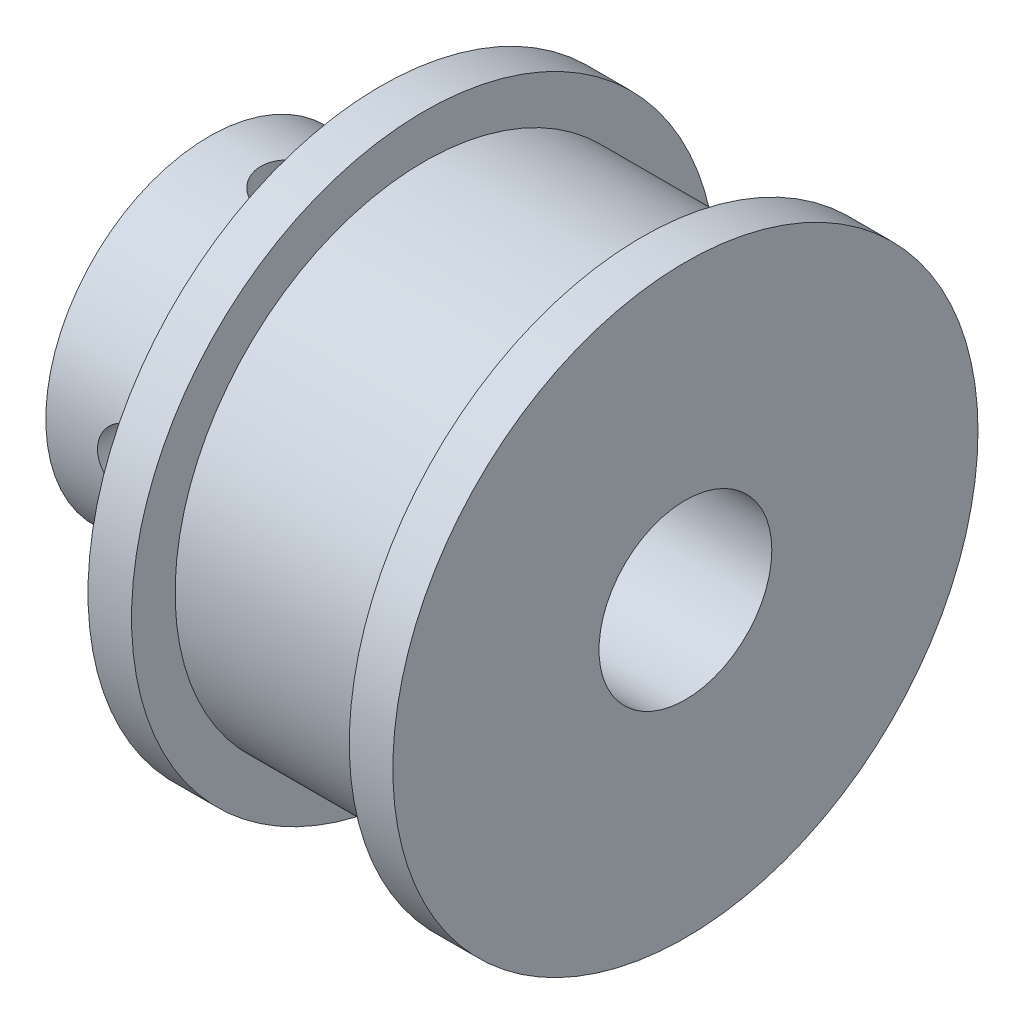
ISO-10303-21;
HEADER;
FILE_DESCRIPTION(('STEP AP214'),'2;1');
FILE_NAME('part.step','',(''),(''),'','','');
FILE_SCHEMA(('AUTOMOTIVE_DESIGN { 1 0 10303 214 1 1 1 1 }'));
ENDSEC;
DATA;
#1=APPLICATION_CONTEXT('core data for automotive mechanical design processes');
#2=APPLICATION_PROTOCOL_DEFINITION('international standard','automotive_design',2000,#1);
#3=PRODUCT_CONTEXT('',#1,'mechanical');
#4=PRODUCT('Part','Part','',(#3));
#5=PRODUCT_RELATED_PRODUCT_CATEGORY('part','',(#4));
#6=PRODUCT_DEFINITION_FORMATION('','',#4);
#7=PRODUCT_DEFINITION_CONTEXT('part definition',#1,'design');
#8=PRODUCT_DEFINITION('design','',#6,#7);
#9=PRODUCT_DEFINITION_SHAPE('','',#8);
#10=(LENGTH_UNIT() NAMED_UNIT(*) SI_UNIT(.MILLI.,.METRE.));
#11=(NAMED_UNIT(*) PLANE_ANGLE_UNIT() SI_UNIT($,.RADIAN.));
#12=(NAMED_UNIT(*) SI_UNIT($,.STERADIAN.) SOLID_ANGLE_UNIT());
#13=UNCERTAINTY_MEASURE_WITH_UNIT(LENGTH_MEASURE(1.E-05),#10,'distance_accuracy_value','');
#14=(GEOMETRIC_REPRESENTATION_CONTEXT(3) GLOBAL_UNCERTAINTY_ASSIGNED_CONTEXT((#13)) GLOBAL_UNIT_ASSIGNED_CONTEXT((#10,
#11,#12)) REPRESENTATION_CONTEXT('',''));
#15=CARTESIAN_POINT('',(0.,0.,0.));
#16=DIRECTION('',(0.,0.,1.));
#17=DIRECTION('',(1.,0.,0.));
#18=AXIS2_PLACEMENT_3D('',#15,#16,#17);
#19=CARTESIAN_POINT('',(0.,0.,0.));
#20=DIRECTION('',(1.,0.,0.));
#21=DIRECTION('',(0.,0.,-1.));
#22=AXIS2_PLACEMENT_3D('',#19,#20,#21);
#23=CYLINDRICAL_SURFACE('',#22,3.175);
#24=CARTESIAN_POINT('',(1.90000000000001,0.,3.175));
#25=CARTESIAN_POINT('',(1.9000068627745,0.0672847316330924,3.17499501338285));
#26=CARTESIAN_POINT('',(1.90546359305505,0.1346703640608,3.17283650663751));
#27=CARTESIAN_POINT('',(1.92710352845715,0.267542369031608,3.16441250521978));
#28=CARTESIAN_POINT('',(1.94331412522152,0.333023444641002,3.15813652319774));
#29=CARTESIAN_POINT('',(1.9857829777871,0.459957962416117,3.14215557601542));
#30=CARTESIAN_POINT('',(2.01200951215206,0.521423409993961,3.1324614438269));
#31=CARTESIAN_POINT('',(2.07364090841074,0.63903164640658,3.11060223187218));
#32=CARTESIAN_POINT('',(2.1090429677438,0.695176053354679,3.09843790684371));
#33=CARTESIAN_POINT('',(2.1897376821198,0.803199302091193,3.07224897424454));
#34=CARTESIAN_POINT('',(2.23538195508738,0.854801684849634,3.05816785515032));
#35=CARTESIAN_POINT('',(2.33452307874792,0.949851027050096,3.029995134943));
#36=CARTESIAN_POINT('',(2.38802352829044,0.993294227940917,3.01590353198658));
#37=CARTESIAN_POINT('',(2.5041424024409,1.07262244667806,2.98863572549245));
#38=CARTESIAN_POINT('',(2.56705314443539,1.10810421355732,2.97552454842956));
#39=CARTESIAN_POINT('',(2.698544027874,1.16785949338492,2.95258553832485));
#40=CARTESIAN_POINT('',(2.7671215628923,1.19213812572271,2.94275620617845));
#41=CARTESIAN_POINT('',(2.90482457540723,1.22768807019404,2.92809906106053));
#42=CARTESIAN_POINT('',(2.97379138336201,1.2394876533875,2.92306908743274));
#43=CARTESIAN_POINT('',(3.11289538673181,1.25139521634013,2.91799267608066));
#44=CARTESIAN_POINT('',(3.18303201481214,1.2515087076257,2.91794388907308));
#45=CARTESIAN_POINT('',(3.31747264612622,1.24044215294952,2.92266241514435));
#46=CARTESIAN_POINT('',(3.38185243388379,1.2300187638983,2.9271070555664));
#47=CARTESIAN_POINT('',(3.50786207063953,1.19943319152663,2.93977143360488));
#48=CARTESIAN_POINT('',(3.56949145415953,1.17926936651212,2.94799180758784));
#49=CARTESIAN_POINT('',(3.68970949878321,1.12939589279822,2.9674595549287));
#50=CARTESIAN_POINT('',(3.74821240698525,1.09950293840843,2.97876432051874));
#51=CARTESIAN_POINT('',(3.85958183190654,1.03114819003906,3.00311044973729));
#52=CARTESIAN_POINT('',(3.91244626347388,0.992683242204219,3.01615245182717));
#53=CARTESIAN_POINT('',(4.01519223792226,0.90489847311778,3.04369028436772));
#54=CARTESIAN_POINT('',(4.06455620057866,0.854982538626526,3.05822195069566));
#55=CARTESIAN_POINT('',(4.15437521291328,0.747422600693478,3.08627133748347));
#56=CARTESIAN_POINT('',(4.19482859712145,0.68977715576794,3.09978886808114));
#57=CARTESIAN_POINT('',(4.26632885010501,0.566964697663757,3.12460676760529));
#58=CARTESIAN_POINT('',(4.29718676961865,0.501677729871156,3.13586122258918));
#59=CARTESIAN_POINT('',(4.34730502697112,0.366284378650628,3.15453954285868));
#60=CARTESIAN_POINT('',(4.36657106552982,0.296180383098904,3.16196529078971));
#61=CARTESIAN_POINT('',(4.39192526522841,0.15748598181363,3.17180954080983));
#62=CARTESIAN_POINT('',(4.398709348115,0.08904145870925,3.174492125026));
#63=CARTESIAN_POINT('',(4.4009546291958,-0.0480536320474739,3.17537559014029));
#64=CARTESIAN_POINT('',(4.39641864995898,-0.116704144074904,3.17357758823769));
#65=CARTESIAN_POINT('',(4.3766688987383,-0.249146112043378,3.1658751934269));
#66=CARTESIAN_POINT('',(4.36192521803439,-0.313019327348947,3.16015168509209));
#67=CARTESIAN_POINT('',(4.32281288402532,-0.437330047990826,3.14535985768854));
#68=CARTESIAN_POINT('',(4.29844298886303,-0.497767108885045,3.1362911070673));
#69=CARTESIAN_POINT('',(4.23997777394203,-0.615550644692232,3.11535083253378));
#70=CARTESIAN_POINT('',(4.20560984846939,-0.672747743207499,3.10340262881889));
#71=CARTESIAN_POINT('',(4.12842792642724,-0.780761917259374,3.07800576012949));
#72=CARTESIAN_POINT('',(4.08561060602606,-0.831576469108153,3.06455650557748));
#73=CARTESIAN_POINT('',(3.98952965745297,-0.928791348114859,3.0365593899859));
#74=CARTESIAN_POINT('',(3.93577293586608,-0.974701227513619,3.02199629492691));
#75=CARTESIAN_POINT('',(3.82105274982168,-1.05696284943212,2.99421855171024));
#76=CARTESIAN_POINT('',(3.76008825217309,-1.09331321924023,2.98100409737911));
#77=CARTESIAN_POINT('',(3.63187774635261,-1.15559997165607,2.95742074651155));
#78=CARTESIAN_POINT('',(3.56458459593159,-1.18144907129597,2.9470759174758));
#79=CARTESIAN_POINT('',(3.4260725952737,-1.2212562072246,2.93080697789355));
#80=CARTESIAN_POINT('',(3.35485655568267,-1.23522264211379,2.92487974538276));
#81=CARTESIAN_POINT('',(3.21589405502895,-1.25007804085777,2.91855940228496));
#82=CARTESIAN_POINT('',(3.1482538653394,-1.25181430561831,2.91780781401761));
#83=CARTESIAN_POINT('',(3.01369577979596,-1.24437120429059,2.92098982763324));
#84=CARTESIAN_POINT('',(2.94677779981834,-1.23519312367105,2.92492287776943));
#85=CARTESIAN_POINT('',(2.81810207173594,-1.20686591196944,2.93671925445626));
#86=CARTESIAN_POINT('',(2.75624498467543,-1.18809939057282,2.9444313340829));
#87=CARTESIAN_POINT('',(2.63652982106708,-1.14148049607648,2.96281485611587));
#88=CARTESIAN_POINT('',(2.57867280512971,-1.1136257243581,2.97348707966731));
#89=CARTESIAN_POINT('',(2.4650674647447,-1.04781462002773,2.99733186522452));
#90=CARTESIAN_POINT('',(2.40961923756217,-1.00937948877753,3.01061106475901));
#91=CARTESIAN_POINT('',(2.30568987821778,-0.924206507043676,3.0378387527675));
#92=CARTESIAN_POINT('',(2.25721118976831,-0.877465757163235,3.05178747371865));
#93=CARTESIAN_POINT('',(2.16551587816836,-0.773553196077986,3.07982295515274));
#94=CARTESIAN_POINT('',(2.12281309958007,-0.715913819660185,3.09386447942524));
#95=CARTESIAN_POINT('',(2.04769454049986,-0.5937664037964,3.11960779538581));
#96=CARTESIAN_POINT('',(2.01528012935281,-0.529257451559142,3.13130927554577));
#97=CARTESIAN_POINT('',(1.96417540099936,-0.400855491445671,3.15020502613284));
#98=CARTESIAN_POINT('',(1.94455266817755,-0.337376283301317,3.15769788512325));
#99=CARTESIAN_POINT('',(1.91563614784328,-0.207895662632507,3.16884766902594));
#100=CARTESIAN_POINT('',(1.90631397142025,-0.141901703524203,3.17251513536217));
#101=CARTESIAN_POINT('',(1.90076135384054,-0.0504531001608372,3.17470085654944));
#102=CARTESIAN_POINT('',(1.8999974262687,-0.0252336457199433,3.17500187012012));
#103=CARTESIAN_POINT('',(1.90000000000001,0.,3.175));
#104=B_SPLINE_CURVE_WITH_KNOTS('',3,(#24,#25,#26,#27,#28,#29,#30,#31,#32,#33,#34,#35,#36,#37,
#38,#39,#40,#41,#42,#43,#44,#45,#46,#47,#48,#49,#50,#51,#52,#53,#54,#55,#56,#57,#58,#59,#60,#61,
#62,#63,#64,#65,#66,#67,#68,#69,#70,#71,#72,#73,#74,#75,#76,#77,#78,#79,#80,#81,#82,#83,#84,#85,
#86,#87,#88,#89,#90,#91,#92,#93,#94,#95,#96,#97,#98,#99,#100,#101,#102,#103),.UNSPECIFIED.,.T.,
.F.,(4,2,2,2,2,2,2,2,2,2,2,2,2,2,2,2,2,2,2,2,2,2,2,2,2,2,2,2,2,2,2,2,2,2,2,2,2,2,2,4),(0.,
0.201779437744548,0.404074820308127,0.605734757050763,0.807333171478417,1.01735976436243,
1.2274828705813,1.44660259463333,1.66562209023744,1.87494520835713,2.08416960269575,
2.27936669865592,2.47459670544107,2.67374147234743,2.87295963102294,3.08705517744558,
3.30119070642572,3.51930901537433,3.73731996902137,3.94275765182502,4.14814411546712,
4.34465147529728,4.54118419440118,4.7436789821994,4.94625358697288,5.1617892735487,
5.37735589340512,5.59467927329235,5.81184892233299,6.01381057507249,6.21574844354767,
6.41019345194811,6.60468982086286,6.81009090996547,7.01556384361703,7.2337987698656,
7.45206273023339,7.65177261299093,7.85093070050895,7.92660360165657),.UNSPECIFIED.);
#105=CARTESIAN_POINT('',(1.90000000000001,0.,3.175));
#106=VERTEX_POINT('',#105);
#107=EDGE_CURVE('E636',#106,#106,#104,.T.);
#108=ORIENTED_EDGE('',*,*,#107,.F.);
#109=EDGE_LOOP('',(#108));
#110=FACE_BOUND('',#109,.T.);
#111=CARTESIAN_POINT('',(3.15,2.91858270398493,-1.25));
#112=CARTESIAN_POINT('',(3.21705876770274,2.91858919552523,-1.24999286391997));
#113=CARTESIAN_POINT('',(3.28421776991305,2.92092645038722,-1.24457161253238));
#114=CARTESIAN_POINT('',(3.41661509708975,2.92998517442319,-1.2230858011541));
#115=CARTESIAN_POINT('',(3.48184795863823,2.93671805691524,-1.20699353198018));
#116=CARTESIAN_POINT('',(3.60825570633315,2.95367783504784,-1.16486992778129));
#117=CARTESIAN_POINT('',(3.66944461339327,2.96389181028401,-1.13887530486567));
#118=CARTESIAN_POINT('',(3.78657755098346,2.98664490940932,-1.07779173231123));
#119=CARTESIAN_POINT('',(3.84252284402701,2.99918347142755,-1.04270497949831));
#120=CARTESIAN_POINT('',(3.95071189018399,3.02595080926506,-0.962353829492942));
#121=CARTESIAN_POINT('',(4.00262881457917,3.04023283739072,-0.916666915264533));
#122=CARTESIAN_POINT('',(4.09830169841413,3.06843728874988,-0.817302314146456));
#123=CARTESIAN_POINT('',(4.1420548518516,3.08235958692784,-0.763621891133198));
#124=CARTESIAN_POINT('',(4.22176349783716,3.10891201177461,-0.64728579706301));
#125=CARTESIAN_POINT('',(4.25735944266869,3.12147292007291,-0.584366556004033));
#126=CARTESIAN_POINT('',(4.31732314068053,3.14324422109986,-0.452850465301555));
#127=CARTESIAN_POINT('',(4.34169532800117,3.15245593668199,-0.384255870461471));
#128=CARTESIAN_POINT('',(4.37736018254707,3.16611423056324,-0.2467608971739));
#129=CARTESIAN_POINT('',(4.38921442617454,3.17076466636064,-0.178026840226493));
#130=CARTESIAN_POINT('',(4.40131288966092,3.17551190440968,-0.0393983009347702));
#131=CARTESIAN_POINT('',(4.40156129942229,3.17561035000669,0.0304957535146294));
#132=CARTESIAN_POINT('',(4.39075388885007,3.17136802875332,0.165409649899385));
#133=CARTESIAN_POINT('',(4.380312782763,3.16726865978232,0.230487686315578));
#134=CARTESIAN_POINT('',(4.34946532592636,3.15541444614498,0.357881536818985));
#135=CARTESIAN_POINT('',(4.32905824593686,3.14765933397851,0.420197148407344));
#136=CARTESIAN_POINT('',(4.27860558354179,3.12910832817148,0.541410179653869));
#137=CARTESIAN_POINT('',(4.24842031728481,3.11826866169305,0.600242482304685));
#138=CARTESIAN_POINT('',(4.17939703639771,3.09462975143761,0.712157346885298));
#139=CARTESIAN_POINT('',(4.1405560971742,3.08182984578998,0.765237956392509));
#140=CARTESIAN_POINT('',(4.05243182003348,3.05461022779038,0.867739124124568));
#141=CARTESIAN_POINT('',(4.00264013608172,3.04013927358102,0.916709689716655));
#142=CARTESIAN_POINT('',(3.89548656480707,3.01184461230875,1.00578635680649));
#143=CARTESIAN_POINT('',(3.83812236311636,2.99802110488019,1.04588973818711));
#144=CARTESIAN_POINT('',(3.71550154425415,2.9722444532213,1.11707822475766));
#145=CARTESIAN_POINT('',(3.6500754582507,2.96035090580402,1.14789479354929));
#146=CARTESIAN_POINT('',(3.5143696785953,2.94047661183176,1.19789603572418));
#147=CARTESIAN_POINT('',(3.44409305117512,2.93249341875955,1.21708798384633));
#148=CARTESIAN_POINT('',(3.30516034266536,2.92193314346724,1.24221885837745));
#149=CARTESIAN_POINT('',(3.2366574611002,2.9190621155793,1.24887973581001));
#150=CARTESIAN_POINT('',(3.09946758767574,2.91821507641654,1.25085924710212));
#151=CARTESIAN_POINT('',(3.03078065469026,2.92023765193577,1.24618115550066));
#152=CARTESIAN_POINT('',(2.89910081239854,2.92864903711891,1.22627220656949));
#153=CARTESIAN_POINT('',(2.83600149325999,2.93479414330475,1.21162973372095));
#154=CARTESIAN_POINT('',(2.71319369775327,2.95045928061593,1.17296502005911));
#155=CARTESIAN_POINT('',(2.65348596177989,2.95998004539956,1.14894074010909));
#156=CARTESIAN_POINT('',(2.53650689226705,2.98178824537218,1.09112415058302));
#157=CARTESIAN_POINT('',(2.47942723563771,2.99417074871089,1.05698098829747));
#158=CARTESIAN_POINT('',(2.37155358654007,3.02015852173764,0.980258179031947));
#159=CARTESIAN_POINT('',(2.32076210314278,3.03376427580628,0.937675181950988));
#160=CARTESIAN_POINT('',(2.22315311375844,3.06183438952279,0.841703377564378));
#161=CARTESIAN_POINT('',(2.17687527629868,3.07629098175068,0.787761391689884));
#162=CARTESIAN_POINT('',(2.09394958907587,3.1035190255834,0.672529083864432));
#163=CARTESIAN_POINT('',(2.05730202921282,3.1162904264532,0.611238540780897));
#164=CARTESIAN_POINT('',(1.99484313276734,3.13873566281396,0.482904338615098));
#165=CARTESIAN_POINT('',(1.96901930828488,3.14841306493411,0.415867417631866));
#166=CARTESIAN_POINT('',(1.92917965457089,3.16357142711523,0.277927786036162));
#167=CARTESIAN_POINT('',(1.91515764017672,3.16905458518296,0.207027121129187));
#168=CARTESIAN_POINT('',(1.90003726977397,3.17497850608976,0.0682260342168539));
#169=CARTESIAN_POINT('',(1.89817498964644,3.17571727826717,0.000420884757595325));
#170=CARTESIAN_POINT('',(1.90542306137319,3.1728670277863,-0.134500374630681));
#171=CARTESIAN_POINT('',(1.9145318409792,3.16927862524971,-0.201616581901098));
#172=CARTESIAN_POINT('',(1.94291936225415,3.15832315585951,-0.331261459507754));
#173=CARTESIAN_POINT('',(1.96189513645233,3.15106882901496,-0.393866748155006));
#174=CARTESIAN_POINT('',(2.00916415022582,3.13355246801338,-0.514998013360591));
#175=CARTESIAN_POINT('',(2.03745913359075,3.12328987099511,-0.573523223978585));
#176=CARTESIAN_POINT('',(2.10396081746341,3.10021124636329,-0.687642991756168));
#177=CARTESIAN_POINT('',(2.14254680575914,3.08730319204293,-0.742997519181306));
#178=CARTESIAN_POINT('',(2.22796048608835,3.0604965861267,-0.846674739986252));
#179=CARTESIAN_POINT('',(2.27479143506869,3.04659764440369,-0.894994640697079));
#180=CARTESIAN_POINT('',(2.3786645370051,3.01835076024438,-0.986204093974814));
#181=CARTESIAN_POINT('',(2.43614870477354,3.00402537078839,-1.02859889387657));
#182=CARTESIAN_POINT('',(2.55787929604743,2.97745127531598,-1.10316965268165));
#183=CARTESIAN_POINT('',(2.62212660256846,2.96520284101944,-1.13534427499941));
#184=CARTESIAN_POINT('',(2.74980593068555,2.94527735121899,-1.18601952811124));
#185=CARTESIAN_POINT('',(2.81281216952646,2.93729286701932,-1.20547430735444));
#186=CARTESIAN_POINT('',(2.94135798876503,2.92533709276108,-1.23421212719399));
#187=CARTESIAN_POINT('',(3.00688989438575,2.92135450819833,-1.24352380081826));
#188=CARTESIAN_POINT('',(3.09843968257498,2.91892238480656,-1.24920484852849));
#189=CARTESIAN_POINT('',(3.12421242994352,2.91858020765141,-1.25000274419244));
#190=CARTESIAN_POINT('',(3.15,2.91858270398493,-1.25));
#191=B_SPLINE_CURVE_WITH_KNOTS('',3,(#111,#112,#113,#114,#115,#116,#117,#118,#119,#120,#121,
#122,#123,#124,#125,#126,#127,#128,#129,#130,#131,#132,#133,#134,#135,#136,#137,#138,#139,#140,
#141,#142,#143,#144,#145,#146,#147,#148,#149,#150,#151,#152,#153,#154,#155,#156,#157,#158,#159,
#160,#161,#162,#163,#164,#165,#166,#167,#168,#169,#170,#171,#172,#173,#174,#175,#176,#177,#178,
#179,#180,#181,#182,#183,#184,#185,#186,#187,#188,#189,#190),.UNSPECIFIED.,.T.,.F.,(4,2,2,2,2,2,
2,2,2,2,2,2,2,2,2,2,2,2,2,2,2,2,2,2,2,2,2,2,2,2,2,2,2,2,2,2,2,2,2,4),(0.,0.20109806062216,
0.402720363484106,0.603602331741175,0.804435808400704,1.01535170829682,1.22633996993093,
1.44534686764129,1.66426716849029,1.87288447318198,2.08142646291369,2.27861453584364,
2.47581703977309,2.67597098178837,2.87619265497002,3.08919652800103,3.30226565219754,
3.52100766319138,3.73961264265535,3.94518390476032,4.1506958077731,4.34501913391243,
4.5393847197749,4.74148953365143,4.94367473209367,5.16024174600764,5.37681527848653,
5.59313824650931,5.80934777198827,6.01183163883026,6.21428649142563,6.41086299855999,
6.60747630956881,6.81268639074811,7.01797771720266,7.23549456942807,7.45303985660975,
7.65144122721413,7.84928106635439,7.92661368823473),.UNSPECIFIED.);
#192=CARTESIAN_POINT('',(3.15,2.91858270398493,-1.25));
#193=VERTEX_POINT('',#192);
#194=EDGE_CURVE('E651',#193,#193,#191,.T.);
#195=ORIENTED_EDGE('',*,*,#194,.F.);
#196=EDGE_LOOP('',(#195));
#197=FACE_BOUND('',#196,.T.);
#198=CARTESIAN_POINT('',(17.5,0.,0.));
#199=DIRECTION('',(1.,0.,0.));
#200=DIRECTION('',(0.,0.,-1.));
#201=AXIS2_PLACEMENT_3D('',#198,#199,#200);
#202=CIRCLE('',#201,3.175);
#203=CARTESIAN_POINT('',(17.5,0.,-3.175));
#204=VERTEX_POINT('',#203);
#205=EDGE_CURVE('E675',#204,#204,#202,.T.);
#206=ORIENTED_EDGE('',*,*,#205,.T.);
#207=EDGE_LOOP('',(#206));
#208=FACE_BOUND('',#207,.T.);
#209=CARTESIAN_POINT('',(0.,0.,0.));
#210=DIRECTION('',(1.,0.,0.));
#211=DIRECTION('',(0.,0.,-1.));
#212=AXIS2_PLACEMENT_3D('',#209,#210,#211);
#213=CIRCLE('',#212,3.175);
#214=CARTESIAN_POINT('',(0.,0.,-3.175));
#215=VERTEX_POINT('',#214);
#216=EDGE_CURVE('E14',#215,#215,#213,.T.);
#217=ORIENTED_EDGE('',*,*,#216,.F.);
#218=EDGE_LOOP('',(#217));
#219=FACE_BOUND('',#218,.T.);
#220=ADVANCED_FACE('F632',(#110,#197,#208,#219),#23,.F.);
#221=CARTESIAN_POINT('',(0.,3.175,0.));
#222=DIRECTION('',(-1.,0.,0.));
#223=DIRECTION('',(0.,0.,1.));
#224=AXIS2_PLACEMENT_3D('',#221,#222,#223);
#225=PLANE('',#224);
#226=ORIENTED_EDGE('',*,*,#216,.T.);
#227=EDGE_LOOP('',(#226));
#228=FACE_BOUND('',#227,.T.);
#229=CARTESIAN_POINT('',(0.,0.,0.));
#230=DIRECTION('',(1.,0.,0.));
#231=DIRECTION('',(0.,0.,-1.));
#232=AXIS2_PLACEMENT_3D('',#229,#230,#231);
#233=CIRCLE('',#232,6.);
#234=CARTESIAN_POINT('',(0.,0.,-6.));
#235=VERTEX_POINT('',#234);
#236=EDGE_CURVE('E643',#235,#235,#233,.T.);
#237=ORIENTED_EDGE('',*,*,#236,.F.);
#238=EDGE_LOOP('',(#237));
#239=FACE_BOUND('',#238,.T.);
#240=ADVANCED_FACE('F684',(#228,#239),#225,.T.);
#241=CARTESIAN_POINT('',(0.,0.,0.));
#242=DIRECTION('',(1.,0.,0.));
#243=DIRECTION('',(0.,0.,-1.));
#244=AXIS2_PLACEMENT_3D('',#241,#242,#243);
#245=CYLINDRICAL_SURFACE('',#244,6.);
#246=CARTESIAN_POINT('',(1.90000000000001,0.,6.));
#247=CARTESIAN_POINT('',(1.90000247746923,-0.0694090417016603,5.99999871526651));
#248=CARTESIAN_POINT('',(1.90580066571876,-0.138848789520875,5.99878328775043));
#249=CARTESIAN_POINT('',(1.92881934953286,-0.275761316266992,5.99405200990679));
#250=CARTESIAN_POINT('',(1.94604852303694,-0.343232560128311,5.99053441189248));
#251=CARTESIAN_POINT('',(1.99137045492183,-0.474209132291339,5.98159109196202));
#252=CARTESIAN_POINT('',(2.01945239599889,-0.537718336709182,5.97616727052645));
#253=CARTESIAN_POINT('',(2.08564960885619,-0.659120328605954,5.96399927809859));
#254=CARTESIAN_POINT('',(2.12376443115584,-0.717013367534323,5.95725516625975));
#255=CARTESIAN_POINT('',(2.20953634019065,-0.826390324308832,5.9430770002465));
#256=CARTESIAN_POINT('',(2.25731200123509,-0.87778024416268,5.93563505848531));
#257=CARTESIAN_POINT('',(2.36079465919511,-0.971877776769387,5.92095657692448));
#258=CARTESIAN_POINT('',(2.41650231187227,-1.01458467096098,5.91372005416683));
#259=CARTESIAN_POINT('',(2.53495196876616,-1.09051031677216,5.90019442595308));
#260=CARTESIAN_POINT('',(2.59775838450275,-1.1236305468065,5.89391545174828));
#261=CARTESIAN_POINT('',(2.72819745177276,-1.17881119348063,5.8831284065002));
#262=CARTESIAN_POINT('',(2.79582958244254,-1.20087280167641,5.87862014467568));
#263=CARTESIAN_POINT('',(2.93298523741564,-1.23300240133736,5.87196500986123));
#264=CARTESIAN_POINT('',(3.00246835933477,-1.24323597696798,5.86978556855865));
#265=CARTESIAN_POINT('',(3.14219684286263,-1.25193357655614,5.86793690716491));
#266=CARTESIAN_POINT('',(3.2124421188653,-1.25039890894686,5.86826740800981));
#267=CARTESIAN_POINT('',(3.35048102797518,-1.23573719037196,5.87137174319175));
#268=CARTESIAN_POINT('',(3.41829597966121,-1.2228010523272,5.87410533679901));
#269=CARTESIAN_POINT('',(3.55077150964493,-1.18600543529945,5.88164437615942));
#270=CARTESIAN_POINT('',(3.61543192560633,-1.16214539481381,5.88644992841317));
#271=CARTESIAN_POINT('',(3.74030722841598,-1.10400003213928,5.89763191464102));
#272=CARTESIAN_POINT('',(3.80048629652707,-1.06964002534236,5.90401953785586));
#273=CARTESIAN_POINT('',(3.91429574426816,-0.991522699274812,5.91763890010721));
#274=CARTESIAN_POINT('',(3.96792530883597,-0.947764212262582,5.92487074398537));
#275=CARTESIAN_POINT('',(4.06821396108037,-0.851074921546777,5.93953730929909));
#276=CARTESIAN_POINT('',(4.11471616889701,-0.797981433412077,5.94697323199473));
#277=CARTESIAN_POINT('',(4.19818044222897,-0.684667288611794,5.96108088143001));
#278=CARTESIAN_POINT('',(4.23514236459839,-0.624446525025762,5.96775259670236));
#279=CARTESIAN_POINT('',(4.29851008153595,-0.498405541235475,5.97959870942815));
#280=CARTESIAN_POINT('',(4.32489680456711,-0.432575461926497,5.98477039710258));
#281=CARTESIAN_POINT('',(4.36619170483549,-0.297284620972153,5.99301338211281));
#282=CARTESIAN_POINT('',(4.38110139323139,-0.227824338595088,5.99608495596053));
#283=CARTESIAN_POINT('',(4.39879425206788,-0.0885918657008349,5.99974275215455));
#284=CARTESIAN_POINT('',(4.40179194149424,-0.0188480555261788,6.00037293537579));
#285=CARTESIAN_POINT('',(4.39615505003089,0.120143798757714,5.99919952252774));
#286=CARTESIAN_POINT('',(4.3875211813984,0.189391872962257,5.99739607548153));
#287=CARTESIAN_POINT('',(4.35904434653046,0.324726367119811,5.99158564979184));
#288=CARTESIAN_POINT('',(4.33931251461653,0.390837192894204,5.98760052868077));
#289=CARTESIAN_POINT('',(4.28932213957859,0.518811446661328,5.97787227242395));
#290=CARTESIAN_POINT('',(4.25906275913401,0.580674536336772,5.97212899744579));
#291=CARTESIAN_POINT('',(4.18841962176244,0.69929430694349,5.95941241490714));
#292=CARTESIAN_POINT('',(4.14790807043093,0.755973219469829,5.9524239381233));
#293=CARTESIAN_POINT('',(4.05808043692373,0.861805445886515,5.93802568299709));
#294=CARTESIAN_POINT('',(4.00876332448106,0.910957877913281,5.93061585542511));
#295=CARTESIAN_POINT('',(3.9017444230003,1.0011786486518,5.91606024531377));
#296=CARTESIAN_POINT('',(3.84391696804472,1.04209914600204,5.90892089307501));
#297=CARTESIAN_POINT('',(3.72208371578621,1.11364719079243,5.89585601015805));
#298=CARTESIAN_POINT('',(3.65807817586089,1.14427516677863,5.88993042894651));
#299=CARTESIAN_POINT('',(3.52603880370177,1.19417246443921,5.88001700708041));
#300=CARTESIAN_POINT('',(3.45802896283416,1.21350309828031,5.87601872784687));
#301=CARTESIAN_POINT('',(3.31963344950774,1.24044038523407,5.87039184709697));
#302=CARTESIAN_POINT('',(3.24924811838056,1.2480487154444,5.86876290660367));
#303=CARTESIAN_POINT('',(3.10958659900035,1.25125926487611,5.86807907308506));
#304=CARTESIAN_POINT('',(3.04031592977795,1.24709542622725,5.86897402321502));
#305=CARTESIAN_POINT('',(2.90348599107978,1.22739905314031,5.87312447254928));
#306=CARTESIAN_POINT('',(2.8359267051839,1.21186662782265,5.87637994909626));
#307=CARTESIAN_POINT('',(2.70460222810934,1.16998217768584,5.88486132447716));
#308=CARTESIAN_POINT('',(2.64082675351308,1.14366117568421,5.8900815700793));
#309=CARTESIAN_POINT('',(2.51856122397334,1.08097457299757,5.90190705738738));
#310=CARTESIAN_POINT('',(2.46007166036688,1.04460803983029,5.9085124276546));
#311=CARTESIAN_POINT('',(2.34887837292056,0.962073695342405,5.92251579551146));
#312=CARTESIAN_POINT('',(2.29630087543502,0.91573789041822,5.92992613868404));
#313=CARTESIAN_POINT('',(2.19959050677365,0.814924438115329,5.94461839583213));
#314=CARTESIAN_POINT('',(2.15545958244852,0.760444918832963,5.9519002798488));
#315=CARTESIAN_POINT('',(2.07641142681595,0.644134427507699,5.96561444547637));
#316=CARTESIAN_POINT('',(2.04160632011372,0.582225921521345,5.97203596073244));
#317=CARTESIAN_POINT('',(1.98294977156998,0.453319843998451,5.98319908494092));
#318=CARTESIAN_POINT('',(1.95908875281813,0.386326781907242,5.98794216182101));
#319=CARTESIAN_POINT('',(1.92745972171158,0.266015292900104,5.99432499781443));
#320=CARTESIAN_POINT('',(1.91718123679115,0.213367593727928,5.99644035661395));
#321=CARTESIAN_POINT('',(1.90345054572268,0.107152674176536,5.99927832789758));
#322=CARTESIAN_POINT('',(1.89999808733282,0.0535854878488715,6.00000099184586));
#323=CARTESIAN_POINT('',(1.90000000000001,0.,6.));
#324=B_SPLINE_CURVE_WITH_KNOTS('',3,(#246,#247,#248,#249,#250,#251,#252,#253,#254,#255,#256,
#257,#258,#259,#260,#261,#262,#263,#264,#265,#266,#267,#268,#269,#270,#271,#272,#273,#274,#275,
#276,#277,#278,#279,#280,#281,#282,#283,#284,#285,#286,#287,#288,#289,#290,#291,#292,#293,#294,
#295,#296,#297,#298,#299,#300,#301,#302,#303,#304,#305,#306,#307,#308,#309,#310,#311,#312,#313,
#314,#315,#316,#317,#318,#319,#320,#321,#322,#323),.UNSPECIFIED.,.T.,.F.,(4,2,2,2,2,2,2,2,2,2,2,
2,2,2,2,2,2,2,2,2,2,2,2,2,2,2,2,2,2,2,2,2,2,2,2,2,2,2,4),(0.,0.208031045103182,
0.416220199906223,0.624202378825439,0.832175241572985,1.04287526388122,1.25359271551785,
1.46640449178548,1.67919333285489,1.88896575169853,2.09871484767163,2.30501712129058,
2.51133000030278,2.71914592416748,2.92698768368033,3.13889526355464,3.35080602278216,
3.5630972449966,3.77536051045769,3.98378339407673,4.19219351552275,4.39855286632619,
4.60492863390931,4.81401583995734,5.02312752564571,5.23571263829333,5.44828889851306,
5.65970050095022,5.87108185414182,6.07829223291035,6.28550062281358,6.49211731393252,
6.69875319081476,6.90919024830305,7.11967575117366,7.33258864398252,7.54531486464969,
7.70592588477276,7.86653096973387),.UNSPECIFIED.);
#325=CARTESIAN_POINT('',(1.90000000000001,0.,6.));
#326=VERTEX_POINT('',#325);
#327=EDGE_CURVE('E657',#326,#326,#324,.T.);
#328=ORIENTED_EDGE('',*,*,#327,.F.);
#329=EDGE_LOOP('',(#328));
#330=FACE_BOUND('',#329,.T.);
#331=CARTESIAN_POINT('',(3.15,5.86834729715275,-1.25));
#332=CARTESIAN_POINT('',(3.08060938484897,5.86834869213645,-1.24999750877599));
#333=CARTESIAN_POINT('',(3.01118802798478,5.86959145924544,-1.24420229433948));
#334=CARTESIAN_POINT('',(2.87431368268275,5.87442015581798,-1.22119649233779));
#335=CARTESIAN_POINT('',(2.80686224449358,5.87800788138388,-1.20397715440342));
#336=CARTESIAN_POINT('',(2.67592762716513,5.8871029296193,-1.1586839750723));
#337=CARTESIAN_POINT('',(2.6124404040082,5.89260825706945,-1.13062141248932));
#338=CARTESIAN_POINT('',(2.4910755003544,5.90491581335741,-1.06446988601732));
#339=CARTESIAN_POINT('',(2.43319759326998,5.91171798977622,-1.0263813273582));
#340=CARTESIAN_POINT('',(2.32380462484654,5.92596934661468,-0.940636399466082));
#341=CARTESIAN_POINT('',(2.27238810637353,5.93342614373039,-0.892855554869668));
#342=CARTESIAN_POINT('',(2.1782389313519,5.94807966802575,-0.789351223880636));
#343=CARTESIAN_POINT('',(2.13550691170856,5.95527637609915,-0.733627155456002));
#344=CARTESIAN_POINT('',(2.05955411191714,5.96868135118848,-0.615162052999588));
#345=CARTESIAN_POINT('',(2.02642747353674,5.97487958631242,-0.552359428204941));
#346=CARTESIAN_POINT('',(1.97123394714022,5.98550347343302,-0.421928551006719));
#347=CARTESIAN_POINT('',(1.94916593484647,5.98992930561222,-0.354300789950591));
#348=CARTESIAN_POINT('',(1.91702423888253,5.99645589892179,-0.217162904200502));
#349=CARTESIAN_POINT('',(1.90678398280484,5.99858891959926,-0.147693380916357));
#350=CARTESIAN_POINT('',(1.89806830424298,6.00040112580612,-0.00799184883952432));
#351=CARTESIAN_POINT('',(1.8995916558069,6.0000805670369,0.0622400797368385));
#352=CARTESIAN_POINT('',(1.91423460095674,5.99704658090511,0.200326586199572));
#353=CARTESIAN_POINT('',(1.92717471895812,5.99437018956584,0.268201128726475));
#354=CARTESIAN_POINT('',(1.96399862533131,5.98696720898885,0.400793746289752));
#355=CARTESIAN_POINT('',(1.98788287720308,5.98224053291904,0.465511687511022));
#356=CARTESIAN_POINT('',(2.0460800521255,5.97120767323924,0.590460005384683));
#357=CARTESIAN_POINT('',(2.08046229420966,5.96489104125346,0.65065713498165));
#358=CARTESIAN_POINT('',(2.15862800284042,5.95137300440189,0.764493456510647));
#359=CARTESIAN_POINT('',(2.20241263820613,5.94417148958325,0.818131831816418));
#360=CARTESIAN_POINT('',(2.29912162489106,5.92951700233276,0.918394203276912));
#361=CARTESIAN_POINT('',(2.35220305998195,5.92206184975925,0.964866487494794));
#362=CARTESIAN_POINT('',(2.4654820489948,5.90786872648996,1.04827597240488));
#363=CARTESIAN_POINT('',(2.52567976138724,5.9011307717716,1.0852129606998));
#364=CARTESIAN_POINT('',(2.6517122548288,5.88912998409156,1.14856217138454));
#365=CARTESIAN_POINT('',(2.71756065069343,5.88387085232125,1.17494805489727));
#366=CARTESIAN_POINT('',(2.85289161936939,5.8754760641036,1.21623577538673));
#367=CARTESIAN_POINT('',(2.92237367280809,5.87234010507182,1.23113924882349));
#368=CARTESIAN_POINT('',(3.06161970631891,5.86860783239132,1.24880863867017));
#369=CARTESIAN_POINT('',(3.13135458453703,5.86796551863474,1.25179442917998));
#370=CARTESIAN_POINT('',(3.27032581154014,5.86916952018704,1.24613693439294));
#371=CARTESIAN_POINT('',(3.33956219090234,5.87101568152623,1.23749436857863));
#372=CARTESIAN_POINT('',(3.47482051605812,5.87694538226166,1.20901558325484));
#373=CARTESIAN_POINT('',(3.54086866717883,5.88100511282998,1.18929841376871));
#374=CARTESIAN_POINT('',(3.6687239894416,5.8908833850312,1.13935810860919));
#375=CARTESIAN_POINT('',(3.7305307856504,5.89670208191057,1.10913404556146));
#376=CARTESIAN_POINT('',(3.84910644121623,5.90954501937191,1.03854598181485));
#377=CARTESIAN_POINT('',(3.90579220446617,5.91658506648323,0.998045327353962));
#378=CARTESIAN_POINT('',(4.01164324915506,5.93103483993908,0.908234440569878));
#379=CARTESIAN_POINT('',(4.06080768623923,5.93844460766532,0.858923220505172));
#380=CARTESIAN_POINT('',(4.15106271309716,5.95294924316736,0.751900450843339));
#381=CARTESIAN_POINT('',(4.19200409502638,5.9600367471991,0.694061907614551));
#382=CARTESIAN_POINT('',(4.26358875208798,5.97296708772407,0.57220010221636));
#383=CARTESIAN_POINT('',(4.29423248223745,5.97880997920818,0.508177113476881));
#384=CARTESIAN_POINT('',(4.34413867931735,5.98856148270679,0.376142117847919));
#385=CARTESIAN_POINT('',(4.36346916554434,5.99248163136497,0.308156710970195));
#386=CARTESIAN_POINT('',(4.3904144040081,5.99799561410226,0.169813400503473));
#387=CARTESIAN_POINT('',(4.39803069353274,5.99958975342889,0.0994558094616958));
#388=CARTESIAN_POINT('',(4.40126762204851,6.00026408056941,-0.0402133434703387));
#389=CARTESIAN_POINT('',(4.39711189999473,5.99939113754811,-0.109519592177922));
#390=CARTESIAN_POINT('',(4.37741936134707,5.99532874094472,-0.246422870373552));
#391=CARTESIAN_POINT('',(4.36188271359323,5.99213932172839,-0.314019925202702));
#392=CARTESIAN_POINT('',(4.31997220535144,5.98380460077544,-0.445431965492052));
#393=CARTESIAN_POINT('',(4.29362733614689,5.97866453407556,-0.509256550004524));
#394=CARTESIAN_POINT('',(4.230877602268,5.96697995347704,-0.631610567220741));
#395=CARTESIAN_POINT('',(4.19447186165686,5.96043531730246,-0.690139538279511));
#396=CARTESIAN_POINT('',(4.11189033200669,5.94651596786386,-0.80134032129826));
#397=CARTESIAN_POINT('',(4.0655557119433,5.93912880302851,-0.853892633615926));
#398=CARTESIAN_POINT('',(3.96475549900292,5.9244278681135,-0.950552741980385));
#399=CARTESIAN_POINT('',(3.91028797005157,5.91711411595368,-0.994658521571232));
#400=CARTESIAN_POINT('',(3.79399089756656,5.90329191643327,-1.07367451852767));
#401=CARTESIAN_POINT('',(3.73208158853791,5.89679406702551,-1.10846928126994));
#402=CARTESIAN_POINT('',(3.60317484391674,5.88547039658063,-1.16710627925306));
#403=CARTESIAN_POINT('',(3.53618195154699,5.88064310352601,-1.1909581629246));
#404=CARTESIAN_POINT('',(3.41589371843157,5.87414004405196,-1.22256554131861));
#405=CARTESIAN_POINT('',(3.36327046340695,5.87198163591589,-1.2328344900567));
#406=CARTESIAN_POINT('',(3.25710421947899,5.86908475266778,-1.24655254358404));
#407=CARTESIAN_POINT('',(3.20356126768996,5.86834622039193,-1.25000192292741));
#408=CARTESIAN_POINT('',(3.15,5.86834729715275,-1.25));
#409=B_SPLINE_CURVE_WITH_KNOTS('',3,(#331,#332,#333,#334,#335,#336,#337,#338,#339,#340,#341,
#342,#343,#344,#345,#346,#347,#348,#349,#350,#351,#352,#353,#354,#355,#356,#357,#358,#359,#360,
#361,#362,#363,#364,#365,#366,#367,#368,#369,#370,#371,#372,#373,#374,#375,#376,#377,#378,#379,
#380,#381,#382,#383,#384,#385,#386,#387,#388,#389,#390,#391,#392,#393,#394,#395,#396,#397,#398,
#399,#400,#401,#402,#403,#404,#405,#406,#407,#408),.UNSPECIFIED.,.T.,.F.,(4,2,2,2,2,2,2,2,2,2,2,
2,2,2,2,2,2,2,2,2,2,2,2,2,2,2,2,2,2,2,2,2,2,2,2,2,2,2,4),(0.,0.207975654071269,0.41611079241747,
0.624030014802729,0.831940834815791,1.04271333467885,1.25350128663874,1.46629026266844,
1.67905760106933,1.88879048859264,2.09850151896339,2.30497341416461,2.5114540545587,
2.71932871977949,2.9272292410426,3.13905862244913,3.35089272191628,3.56325237332487,
3.77558175387597,3.98397516009792,4.19235567296524,4.39853786231922,4.60473825464031,
4.81383917934651,5.02296356082185,5.23559458753343,5.4482162175904,5.65954599648534,
5.87084803959581,6.07816293922644,6.28547476332981,6.492234105851,6.69901145528173,
6.90938318978573,7.11980508427535,7.33272651358123,7.54545984571988,7.70599867585769,
7.8665310426116),.UNSPECIFIED.);
#410=CARTESIAN_POINT('',(3.15,5.86834729715275,-1.25));
#411=VERTEX_POINT('',#410);
#412=EDGE_CURVE('E656',#411,#411,#409,.T.);
#413=ORIENTED_EDGE('',*,*,#412,.F.);
#414=EDGE_LOOP('',(#413));
#415=FACE_BOUND('',#414,.T.);
#416=ORIENTED_EDGE('',*,*,#236,.T.);
#417=EDGE_LOOP('',(#416));
#418=FACE_BOUND('',#417,.T.);
#419=CARTESIAN_POINT('',(6.3,0.,0.));
#420=DIRECTION('',(1.,0.,0.));
#421=DIRECTION('',(0.,0.,-1.));
#422=AXIS2_PLACEMENT_3D('',#419,#420,#421);
#423=CIRCLE('',#422,6.);
#424=CARTESIAN_POINT('',(6.3,0.,-6.));
#425=VERTEX_POINT('',#424);
#426=EDGE_CURVE('E648',#425,#425,#423,.T.);
#427=ORIENTED_EDGE('',*,*,#426,.F.);
#428=EDGE_LOOP('',(#427));
#429=FACE_BOUND('',#428,.T.);
#430=ADVANCED_FACE('F679',(#330,#415,#418,#429),#245,.T.);
#431=CARTESIAN_POINT('',(6.3,10.75,0.));
#432=DIRECTION('',(-1.,0.,0.));
#433=DIRECTION('',(0.,0.,1.));
#434=AXIS2_PLACEMENT_3D('',#431,#432,#433);
#435=PLANE('',#434);
#436=ORIENTED_EDGE('',*,*,#426,.T.);
#437=EDGE_LOOP('',(#436));
#438=FACE_BOUND('',#437,.T.);
#439=CARTESIAN_POINT('',(6.3,0.,0.));
#440=DIRECTION('',(1.,0.,0.));
#441=DIRECTION('',(0.,0.,-1.));
#442=AXIS2_PLACEMENT_3D('',#439,#440,#441);
#443=CIRCLE('',#442,10.75);
#444=CARTESIAN_POINT('',(6.3,0.,-10.75));
#445=VERTEX_POINT('',#444);
#446=EDGE_CURVE('E700',#445,#445,#443,.T.);
#447=ORIENTED_EDGE('',*,*,#446,.F.);
#448=EDGE_LOOP('',(#447));
#449=FACE_BOUND('',#448,.T.);
#450=ADVANCED_FACE('F683',(#438,#449),#435,.T.);
#451=CARTESIAN_POINT('',(0.,0.,0.));
#452=DIRECTION('',(1.,0.,0.));
#453=DIRECTION('',(0.,0.,-1.));
#454=AXIS2_PLACEMENT_3D('',#451,#452,#453);
#455=CYLINDRICAL_SURFACE('',#454,10.75);
#456=ORIENTED_EDGE('',*,*,#446,.T.);
#457=EDGE_LOOP('',(#456));
#458=FACE_BOUND('',#457,.T.);
#459=CARTESIAN_POINT('',(7.9,0.,0.));
#460=DIRECTION('',(1.,0.,0.));
#461=DIRECTION('',(0.,0.,-1.));
#462=AXIS2_PLACEMENT_3D('',#459,#460,#461);
#463=CIRCLE('',#462,10.75);
#464=CARTESIAN_POINT('',(7.9,0.,-10.75));
#465=VERTEX_POINT('',#464);
#466=EDGE_CURVE('E702',#465,#465,#463,.T.);
#467=ORIENTED_EDGE('',*,*,#466,.F.);
#468=EDGE_LOOP('',(#467));
#469=FACE_BOUND('',#468,.T.);
#470=ADVANCED_FACE('F744',(#458,#469),#455,.T.);
#471=CARTESIAN_POINT('',(7.9,10.75,0.));
#472=DIRECTION('',(1.,0.,0.));
#473=DIRECTION('',(0.,0.,-1.));
#474=AXIS2_PLACEMENT_3D('',#471,#472,#473);
#475=PLANE('',#474);
#476=ORIENTED_EDGE('',*,*,#466,.T.);
#477=EDGE_LOOP('',(#476));
#478=FACE_BOUND('',#477,.T.);
#479=CARTESIAN_POINT('',(7.9,0.,0.));
#480=DIRECTION('',(1.,0.,0.));
#481=DIRECTION('',(0.,0.,-1.));
#482=AXIS2_PLACEMENT_3D('',#479,#480,#481);
#483=CIRCLE('',#482,9.15);
#484=CARTESIAN_POINT('',(7.9,0.,-9.15));
#485=VERTEX_POINT('',#484);
#486=EDGE_CURVE('E707',#485,#485,#483,.T.);
#487=ORIENTED_EDGE('',*,*,#486,.F.);
#488=EDGE_LOOP('',(#487));
#489=FACE_BOUND('',#488,.T.);
#490=ADVANCED_FACE('F741',(#478,#489),#475,.T.);
#491=CARTESIAN_POINT('',(0.,0.,0.));
#492=DIRECTION('',(1.,0.,0.));
#493=DIRECTION('',(0.,0.,-1.));
#494=AXIS2_PLACEMENT_3D('',#491,#492,#493);
#495=CYLINDRICAL_SURFACE('',#494,9.15);
#496=ORIENTED_EDGE('',*,*,#486,.T.);
#497=EDGE_LOOP('',(#496));
#498=FACE_BOUND('',#497,.T.);
#499=CARTESIAN_POINT('',(15.9,0.,0.));
#500=DIRECTION('',(1.,0.,0.));
#501=DIRECTION('',(0.,0.,-1.));
#502=AXIS2_PLACEMENT_3D('',#499,#500,#501);
#503=CIRCLE('',#502,9.15);
#504=CARTESIAN_POINT('',(15.9,0.,-9.15));
#505=VERTEX_POINT('',#504);
#506=EDGE_CURVE('E710',#505,#505,#503,.T.);
#507=ORIENTED_EDGE('',*,*,#506,.F.);
#508=EDGE_LOOP('',(#507));
#509=FACE_BOUND('',#508,.T.);
#510=ADVANCED_FACE('F734',(#498,#509),#495,.T.);
#511=CARTESIAN_POINT('',(15.9,9.15,0.));
#512=DIRECTION('',(-1.,0.,0.));
#513=DIRECTION('',(0.,0.,1.));
#514=AXIS2_PLACEMENT_3D('',#511,#512,#513);
#515=PLANE('',#514);
#516=ORIENTED_EDGE('',*,*,#506,.T.);
#517=EDGE_LOOP('',(#516));
#518=FACE_BOUND('',#517,.T.);
#519=CARTESIAN_POINT('',(15.9,0.,0.));
#520=DIRECTION('',(1.,0.,0.));
#521=DIRECTION('',(0.,0.,-1.));
#522=AXIS2_PLACEMENT_3D('',#519,#520,#521);
#523=CIRCLE('',#522,10.75);
#524=CARTESIAN_POINT('',(15.9,0.,-10.75));
#525=VERTEX_POINT('',#524);
#526=EDGE_CURVE('E713',#525,#525,#523,.T.);
#527=ORIENTED_EDGE('',*,*,#526,.F.);
#528=EDGE_LOOP('',(#527));
#529=FACE_BOUND('',#528,.T.);
#530=ADVANCED_FACE('F729',(#518,#529),#515,.T.);
#531=CARTESIAN_POINT('',(0.,0.,0.));
#532=DIRECTION('',(1.,0.,0.));
#533=DIRECTION('',(0.,0.,-1.));
#534=AXIS2_PLACEMENT_3D('',#531,#532,#533);
#535=CYLINDRICAL_SURFACE('',#534,10.75);
#536=ORIENTED_EDGE('',*,*,#526,.T.);
#537=EDGE_LOOP('',(#536));
#538=FACE_BOUND('',#537,.T.);
#539=CARTESIAN_POINT('',(17.5,0.,0.));
#540=DIRECTION('',(1.,0.,0.));
#541=DIRECTION('',(0.,0.,-1.));
#542=AXIS2_PLACEMENT_3D('',#539,#540,#541);
#543=CIRCLE('',#542,10.75);
#544=CARTESIAN_POINT('',(17.5,0.,-10.75));
#545=VERTEX_POINT('',#544);
#546=EDGE_CURVE('E715',#545,#545,#543,.T.);
#547=ORIENTED_EDGE('',*,*,#546,.F.);
#548=EDGE_LOOP('',(#547));
#549=FACE_BOUND('',#548,.T.);
#550=ADVANCED_FACE('F725',(#538,#549),#535,.T.);
#551=CARTESIAN_POINT('',(17.5,10.75,0.));
#552=DIRECTION('',(1.,0.,0.));
#553=DIRECTION('',(0.,0.,-1.));
#554=AXIS2_PLACEMENT_3D('',#551,#552,#553);
#555=PLANE('',#554);
#556=ORIENTED_EDGE('',*,*,#546,.T.);
#557=EDGE_LOOP('',(#556));
#558=FACE_BOUND('',#557,.T.);
#559=ORIENTED_EDGE('',*,*,#205,.F.);
#560=EDGE_LOOP('',(#559));
#561=FACE_BOUND('',#560,.T.);
#562=ADVANCED_FACE('F663',(#558,#561),#555,.T.);
#563=CARTESIAN_POINT('',(3.15,0.,0.));
#564=DIRECTION('',(0.,-1.,0.));
#565=DIRECTION('',(0.,0.,-1.));
#566=AXIS2_PLACEMENT_3D('',#563,#564,#565);
#567=CYLINDRICAL_SURFACE('',#566,1.25);
#568=ORIENTED_EDGE('',*,*,#412,.T.);
#569=EDGE_LOOP('',(#568));
#570=FACE_BOUND('',#569,.T.);
#571=ORIENTED_EDGE('',*,*,#194,.T.);
#572=EDGE_LOOP('',(#571));
#573=FACE_BOUND('',#572,.T.);
#574=ADVANCED_FACE('F658',(#570,#573),#567,.F.);
#575=CARTESIAN_POINT('',(3.15,0.,0.));
#576=DIRECTION('',(0.,0.,-1.));
#577=DIRECTION('',(-1.,0.,0.));
#578=AXIS2_PLACEMENT_3D('',#575,#576,#577);
#579=CYLINDRICAL_SURFACE('',#578,1.24999999999999);
#580=ORIENTED_EDGE('',*,*,#327,.T.);
#581=EDGE_LOOP('',(#580));
#582=FACE_BOUND('',#581,.T.);
#583=ORIENTED_EDGE('',*,*,#107,.T.);
#584=EDGE_LOOP('',(#583));
#585=FACE_BOUND('',#584,.T.);
#586=ADVANCED_FACE('F662',(#582,#585),#579,.F.);
#587=CLOSED_SHELL('',(#220,#240,#430,#450,#470,#490,#510,#530,#550,#562,#574,#586));
#588=MANIFOLD_SOLID_BREP('B2',#587);
#589=ADVANCED_BREP_SHAPE_REPRESENTATION('',(#18,#588),#14);
#590=SHAPE_DEFINITION_REPRESENTATION(#9,#589);
ENDSEC;
END-ISO-10303-21;
